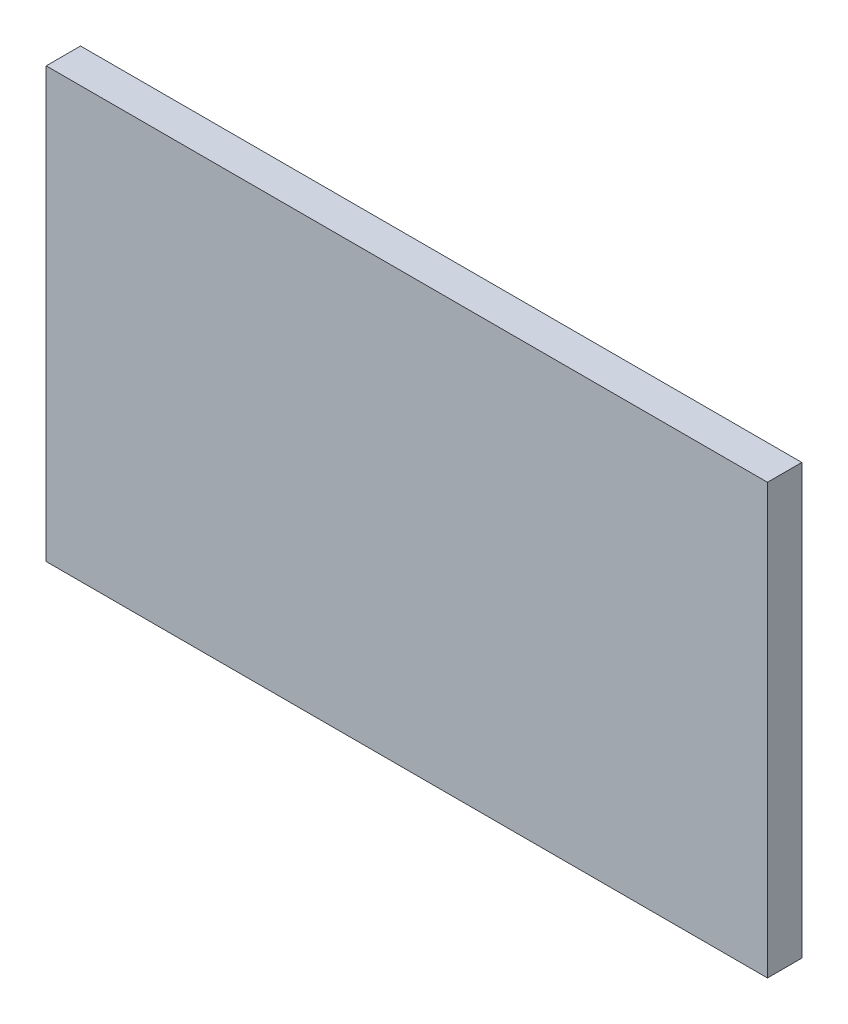
ISO-10303-21;
HEADER;
FILE_DESCRIPTION(('STEP AP214'),'2;1');
FILE_NAME('part.step','',(''),(''),'','','');
FILE_SCHEMA(('AUTOMOTIVE_DESIGN { 1 0 10303 214 1 1 1 1 }'));
ENDSEC;
DATA;
#1=APPLICATION_CONTEXT('core data for automotive mechanical design processes');
#2=APPLICATION_PROTOCOL_DEFINITION('international standard','automotive_design',2000,#1);
#3=PRODUCT_CONTEXT('',#1,'mechanical');
#4=PRODUCT('Part','Part','',(#3));
#5=PRODUCT_RELATED_PRODUCT_CATEGORY('part','',(#4));
#6=PRODUCT_DEFINITION_FORMATION('','',#4);
#7=PRODUCT_DEFINITION_CONTEXT('part definition',#1,'design');
#8=PRODUCT_DEFINITION('design','',#6,#7);
#9=PRODUCT_DEFINITION_SHAPE('','',#8);
#10=(LENGTH_UNIT() NAMED_UNIT(*) SI_UNIT(.MILLI.,.METRE.));
#11=(NAMED_UNIT(*) PLANE_ANGLE_UNIT() SI_UNIT($,.RADIAN.));
#12=(NAMED_UNIT(*) SI_UNIT($,.STERADIAN.) SOLID_ANGLE_UNIT());
#13=UNCERTAINTY_MEASURE_WITH_UNIT(LENGTH_MEASURE(1.E-05),#10,'distance_accuracy_value','');
#14=(GEOMETRIC_REPRESENTATION_CONTEXT(3) GLOBAL_UNCERTAINTY_ASSIGNED_CONTEXT((#13)) GLOBAL_UNIT_ASSIGNED_CONTEXT((#10,
#11,#12)) REPRESENTATION_CONTEXT('',''));
#15=CARTESIAN_POINT('',(0.,0.,0.));
#16=DIRECTION('',(0.,0.,1.));
#17=DIRECTION('',(1.,0.,0.));
#18=AXIS2_PLACEMENT_3D('',#15,#16,#17);
#19=CARTESIAN_POINT('',(0.,0.,20.));
#20=DIRECTION('',(1.,0.,0.));
#21=DIRECTION('',(0.,0.,-1.));
#22=AXIS2_PLACEMENT_3D('',#19,#20,#21);
#23=PLANE('',#22);
#24=DIRECTION('',(0.,-1.,0.));
#25=VECTOR('',#24,1.);
#26=CARTESIAN_POINT('',(0.,0.,0.));
#27=LINE('',#26,#25);
#28=CARTESIAN_POINT('',(0.,250.,0.));
#29=VERTEX_POINT('',#28);
#30=CARTESIAN_POINT('',(0.,0.,0.));
#31=VERTEX_POINT('',#30);
#32=EDGE_CURVE('E100',#29,#31,#27,.T.);
#33=ORIENTED_EDGE('',*,*,#32,.T.);
#34=DIRECTION('',(0.,0.,-1.));
#35=VECTOR('',#34,1.);
#36=CARTESIAN_POINT('',(0.,0.,20.));
#37=LINE('',#36,#35);
#38=CARTESIAN_POINT('',(0.,0.,20.));
#39=VERTEX_POINT('',#38);
#40=EDGE_CURVE('E11',#39,#31,#37,.T.);
#41=ORIENTED_EDGE('',*,*,#40,.F.);
#42=DIRECTION('',(0.,-1.,0.));
#43=VECTOR('',#42,1.);
#44=CARTESIAN_POINT('',(0.,0.,20.));
#45=LINE('',#44,#43);
#46=CARTESIAN_POINT('',(0.,250.,20.));
#47=VERTEX_POINT('',#46);
#48=EDGE_CURVE('E88',#47,#39,#45,.T.);
#49=ORIENTED_EDGE('',*,*,#48,.F.);
#50=DIRECTION('',(0.,0.,-1.));
#51=VECTOR('',#50,1.);
#52=CARTESIAN_POINT('',(0.,250.,20.));
#53=LINE('',#52,#51);
#54=EDGE_CURVE('E96',#47,#29,#53,.T.);
#55=ORIENTED_EDGE('',*,*,#54,.T.);
#56=EDGE_LOOP('',(#33,#41,#49,#55));
#57=FACE_BOUND('',#56,.T.);
#58=ADVANCED_FACE('F37',(#57),#23,.F.);
#59=CARTESIAN_POINT('',(0.,0.,20.));
#60=DIRECTION('',(0.,1.,0.));
#61=DIRECTION('',(0.,0.,1.));
#62=AXIS2_PLACEMENT_3D('',#59,#60,#61);
#63=PLANE('',#62);
#64=DIRECTION('',(1.,0.,0.));
#65=VECTOR('',#64,1.);
#66=CARTESIAN_POINT('',(0.,0.,0.));
#67=LINE('',#66,#65);
#68=CARTESIAN_POINT('',(420.,0.,0.));
#69=VERTEX_POINT('',#68);
#70=EDGE_CURVE('E92',#31,#69,#67,.T.);
#71=ORIENTED_EDGE('',*,*,#70,.T.);
#72=DIRECTION('',(0.,0.,-1.));
#73=VECTOR('',#72,1.);
#74=CARTESIAN_POINT('',(420.,0.,20.));
#75=LINE('',#74,#73);
#76=CARTESIAN_POINT('',(420.,0.,20.));
#77=VERTEX_POINT('',#76);
#78=EDGE_CURVE('E45',#77,#69,#75,.T.);
#79=ORIENTED_EDGE('',*,*,#78,.F.);
#80=DIRECTION('',(1.,0.,0.));
#81=VECTOR('',#80,1.);
#82=CARTESIAN_POINT('',(0.,0.,20.));
#83=LINE('',#82,#81);
#84=EDGE_CURVE('E83',#39,#77,#83,.T.);
#85=ORIENTED_EDGE('',*,*,#84,.F.);
#86=ORIENTED_EDGE('',*,*,#40,.T.);
#87=EDGE_LOOP('',(#71,#79,#85,#86));
#88=FACE_BOUND('',#87,.T.);
#89=ADVANCED_FACE('F91',(#88),#63,.F.);
#90=CARTESIAN_POINT('',(420.,0.,20.));
#91=DIRECTION('',(-1.,0.,0.));
#92=DIRECTION('',(0.,0.,1.));
#93=AXIS2_PLACEMENT_3D('',#90,#91,#92);
#94=PLANE('',#93);
#95=DIRECTION('',(0.,1.,0.));
#96=VECTOR('',#95,1.);
#97=CARTESIAN_POINT('',(420.,0.,0.));
#98=LINE('',#97,#96);
#99=CARTESIAN_POINT('',(420.,250.,0.));
#100=VERTEX_POINT('',#99);
#101=EDGE_CURVE('E70',#69,#100,#98,.T.);
#102=ORIENTED_EDGE('',*,*,#101,.T.);
#103=DIRECTION('',(0.,0.,-1.));
#104=VECTOR('',#103,1.);
#105=CARTESIAN_POINT('',(420.,250.,20.));
#106=LINE('',#105,#104);
#107=CARTESIAN_POINT('',(420.,250.,20.));
#108=VERTEX_POINT('',#107);
#109=EDGE_CURVE('E93',#108,#100,#106,.T.);
#110=ORIENTED_EDGE('',*,*,#109,.F.);
#111=DIRECTION('',(0.,1.,0.));
#112=VECTOR('',#111,1.);
#113=CARTESIAN_POINT('',(420.,0.,20.));
#114=LINE('',#113,#112);
#115=EDGE_CURVE('E86',#77,#108,#114,.T.);
#116=ORIENTED_EDGE('',*,*,#115,.F.);
#117=ORIENTED_EDGE('',*,*,#78,.T.);
#118=EDGE_LOOP('',(#102,#110,#116,#117));
#119=FACE_BOUND('',#118,.T.);
#120=ADVANCED_FACE('F94',(#119),#94,.F.);
#121=CARTESIAN_POINT('',(0.,250.,20.));
#122=DIRECTION('',(0.,-1.,0.));
#123=DIRECTION('',(0.,0.,-1.));
#124=AXIS2_PLACEMENT_3D('',#121,#122,#123);
#125=PLANE('',#124);
#126=DIRECTION('',(-1.,0.,0.));
#127=VECTOR('',#126,1.);
#128=CARTESIAN_POINT('',(0.,250.,0.));
#129=LINE('',#128,#127);
#130=EDGE_CURVE('E76',#100,#29,#129,.T.);
#131=ORIENTED_EDGE('',*,*,#130,.T.);
#132=ORIENTED_EDGE('',*,*,#54,.F.);
#133=DIRECTION('',(-1.,0.,0.));
#134=VECTOR('',#133,1.);
#135=CARTESIAN_POINT('',(0.,250.,20.));
#136=LINE('',#135,#134);
#137=EDGE_CURVE('E53',#108,#47,#136,.T.);
#138=ORIENTED_EDGE('',*,*,#137,.F.);
#139=ORIENTED_EDGE('',*,*,#109,.T.);
#140=EDGE_LOOP('',(#131,#132,#138,#139));
#141=FACE_BOUND('',#140,.T.);
#142=ADVANCED_FACE('F107',(#141),#125,.F.);
#143=CARTESIAN_POINT('',(0.,0.,20.));
#144=DIRECTION('',(0.,0.,-1.));
#145=DIRECTION('',(-1.,0.,0.));
#146=AXIS2_PLACEMENT_3D('',#143,#144,#145);
#147=PLANE('',#146);
#148=ORIENTED_EDGE('',*,*,#48,.T.);
#149=ORIENTED_EDGE('',*,*,#84,.T.);
#150=ORIENTED_EDGE('',*,*,#115,.T.);
#151=ORIENTED_EDGE('',*,*,#137,.T.);
#152=EDGE_LOOP('',(#148,#149,#150,#151));
#153=FACE_BOUND('',#152,.T.);
#154=ADVANCED_FACE('F84',(#153),#147,.F.);
#155=CARTESIAN_POINT('',(0.,0.,0.));
#156=DIRECTION('',(0.,0.,-1.));
#157=DIRECTION('',(-1.,0.,0.));
#158=AXIS2_PLACEMENT_3D('',#155,#156,#157);
#159=PLANE('',#158);
#160=ORIENTED_EDGE('',*,*,#32,.F.);
#161=ORIENTED_EDGE('',*,*,#130,.F.);
#162=ORIENTED_EDGE('',*,*,#101,.F.);
#163=ORIENTED_EDGE('',*,*,#70,.F.);
#164=EDGE_LOOP('',(#160,#161,#162,#163));
#165=FACE_BOUND('',#164,.T.);
#166=ADVANCED_FACE('F110',(#165),#159,.T.);
#167=CLOSED_SHELL('',(#58,#89,#120,#142,#154,#166));
#168=MANIFOLD_SOLID_BREP('B2',#167);
#169=ADVANCED_BREP_SHAPE_REPRESENTATION('',(#18,#168),#14);
#170=SHAPE_DEFINITION_REPRESENTATION(#9,#169);
ENDSEC;
END-ISO-10303-21;
